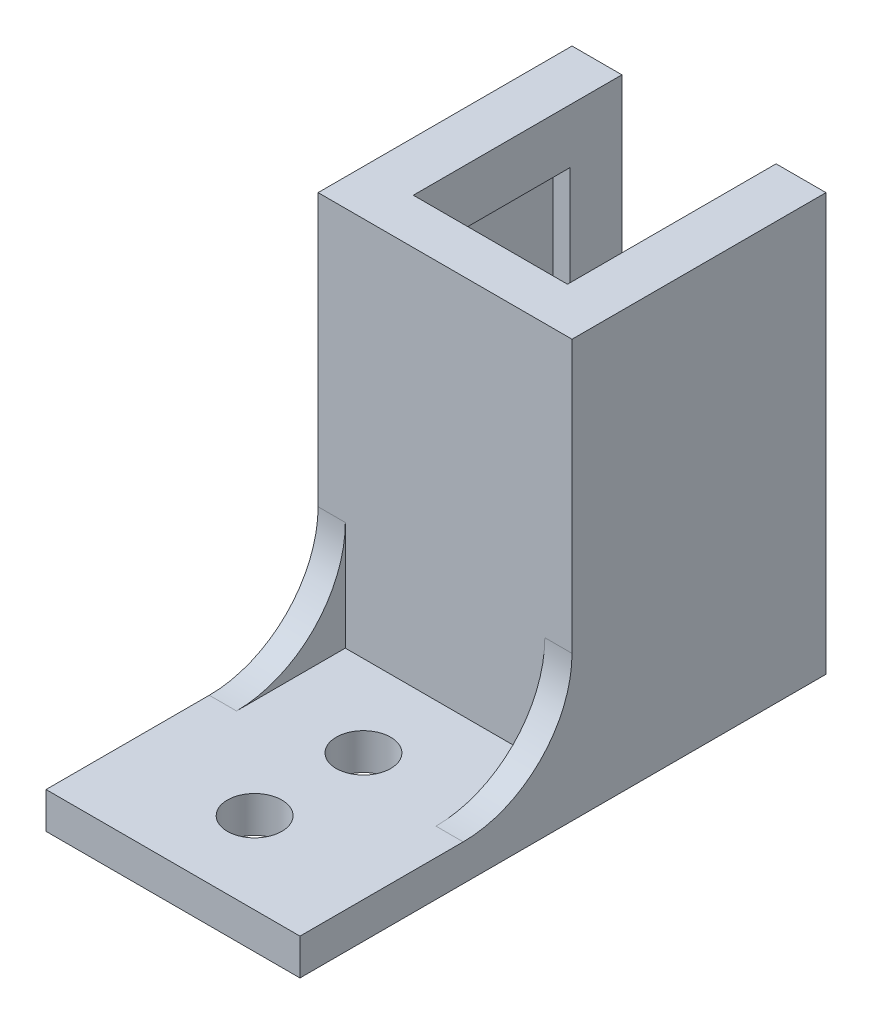
ISO-10303-21;
HEADER;
FILE_DESCRIPTION(('STEP AP214'),'2;1');
FILE_NAME('part.step','',(''),(''),'','','');
FILE_SCHEMA(('AUTOMOTIVE_DESIGN { 1 0 10303 214 1 1 1 1 }'));
ENDSEC;
DATA;
#1=APPLICATION_CONTEXT('core data for automotive mechanical design processes');
#2=APPLICATION_PROTOCOL_DEFINITION('international standard','automotive_design',2000,#1);
#3=PRODUCT_CONTEXT('',#1,'mechanical');
#4=PRODUCT('Part','Part','',(#3));
#5=PRODUCT_RELATED_PRODUCT_CATEGORY('part','',(#4));
#6=PRODUCT_DEFINITION_FORMATION('','',#4);
#7=PRODUCT_DEFINITION_CONTEXT('part definition',#1,'design');
#8=PRODUCT_DEFINITION('design','',#6,#7);
#9=PRODUCT_DEFINITION_SHAPE('','',#8);
#10=(LENGTH_UNIT() NAMED_UNIT(*) SI_UNIT(.MILLI.,.METRE.));
#11=(NAMED_UNIT(*) PLANE_ANGLE_UNIT() SI_UNIT($,.RADIAN.));
#12=(NAMED_UNIT(*) SI_UNIT($,.STERADIAN.) SOLID_ANGLE_UNIT());
#13=UNCERTAINTY_MEASURE_WITH_UNIT(LENGTH_MEASURE(1.E-05),#10,'distance_accuracy_value','');
#14=(GEOMETRIC_REPRESENTATION_CONTEXT(3) GLOBAL_UNCERTAINTY_ASSIGNED_CONTEXT((#13)) GLOBAL_UNIT_ASSIGNED_CONTEXT((#10,
#11,#12)) REPRESENTATION_CONTEXT('',''));
#15=CARTESIAN_POINT('',(0.,0.,0.));
#16=DIRECTION('',(0.,0.,1.));
#17=DIRECTION('',(1.,0.,0.));
#18=AXIS2_PLACEMENT_3D('',#15,#16,#17);
#19=CARTESIAN_POINT('',(0.,0.,0.));
#20=DIRECTION('',(0.,0.,1.));
#21=DIRECTION('',(1.,0.,0.));
#22=AXIS2_PLACEMENT_3D('',#19,#20,#21);
#23=PLANE('',#22);
#24=DIRECTION('',(0.,-1.,0.));
#25=VECTOR('',#24,1.);
#26=CARTESIAN_POINT('',(4.25,8.5,0.));
#27=LINE('',#26,#25);
#28=CARTESIAN_POINT('',(4.25,11.5,0.));
#29=VERTEX_POINT('',#28);
#30=CARTESIAN_POINT('',(4.25,-11.5,0.));
#31=VERTEX_POINT('',#30);
#32=EDGE_CURVE('E348',#29,#31,#27,.T.);
#33=ORIENTED_EDGE('',*,*,#32,.F.);
#34=DIRECTION('',(-1.,0.,0.));
#35=VECTOR('',#34,1.);
#36=CARTESIAN_POINT('',(0.,11.5,0.));
#37=LINE('',#36,#35);
#38=CARTESIAN_POINT('',(7.,11.5,0.));
#39=VERTEX_POINT('',#38);
#40=EDGE_CURVE('E200',#39,#29,#37,.T.);
#41=ORIENTED_EDGE('',*,*,#40,.F.);
#42=DIRECTION('',(0.,-1.,0.));
#43=VECTOR('',#42,1.);
#44=CARTESIAN_POINT('',(7.,0.,0.));
#45=LINE('',#44,#43);
#46=CARTESIAN_POINT('',(7.,-11.5,0.));
#47=VERTEX_POINT('',#46);
#48=EDGE_CURVE('E365',#39,#47,#45,.T.);
#49=ORIENTED_EDGE('',*,*,#48,.T.);
#50=DIRECTION('',(-1.,0.,0.));
#51=VECTOR('',#50,1.);
#52=CARTESIAN_POINT('',(0.,-11.5,0.));
#53=LINE('',#52,#51);
#54=EDGE_CURVE('E380',#47,#31,#53,.T.);
#55=ORIENTED_EDGE('',*,*,#54,.T.);
#56=EDGE_LOOP('',(#33,#41,#49,#55));
#57=FACE_BOUND('',#56,.T.);
#58=ADVANCED_FACE('F41',(#57),#23,.F.);
#59=CARTESIAN_POINT('',(0.,8.5,0.));
#60=DIRECTION('',(0.,-1.,0.));
#61=DIRECTION('',(1.,0.,0.));
#62=AXIS2_PLACEMENT_3D('',#59,#60,#61);
#63=PLANE('',#62);
#64=DIRECTION('',(0.,0.,1.));
#65=VECTOR('',#64,1.);
#66=CARTESIAN_POINT('',(4.25,8.5,0.));
#67=LINE('',#66,#65);
#68=CARTESIAN_POINT('',(4.25,8.5,2.85));
#69=VERTEX_POINT('',#68);
#70=CARTESIAN_POINT('',(4.25,8.5,11.5));
#71=VERTEX_POINT('',#70);
#72=EDGE_CURVE('E11',#69,#71,#67,.T.);
#73=ORIENTED_EDGE('',*,*,#72,.F.);
#74=DIRECTION('',(-1.,0.,0.));
#75=VECTOR('',#74,1.);
#76=CARTESIAN_POINT('',(0.,8.5,2.85));
#77=LINE('',#76,#75);
#78=CARTESIAN_POINT('',(5.2,8.5,2.85));
#79=VERTEX_POINT('',#78);
#80=EDGE_CURVE('E304',#79,#69,#77,.T.);
#81=ORIENTED_EDGE('',*,*,#80,.F.);
#82=DIRECTION('',(0.,0.,1.));
#83=VECTOR('',#82,1.);
#84=CARTESIAN_POINT('',(5.2,8.5,0.));
#85=LINE('',#84,#83);
#86=CARTESIAN_POINT('',(5.2,8.5,11.5));
#87=VERTEX_POINT('',#86);
#88=EDGE_CURVE('E305',#79,#87,#85,.T.);
#89=ORIENTED_EDGE('',*,*,#88,.T.);
#90=DIRECTION('',(-1.,0.,0.));
#91=VECTOR('',#90,1.);
#92=CARTESIAN_POINT('',(0.,8.5,11.5));
#93=LINE('',#92,#91);
#94=EDGE_CURVE('E310',#87,#71,#93,.T.);
#95=ORIENTED_EDGE('',*,*,#94,.T.);
#96=EDGE_LOOP('',(#73,#81,#89,#95));
#97=FACE_BOUND('',#96,.T.);
#98=ADVANCED_FACE('F469',(#97),#63,.T.);
#99=CARTESIAN_POINT('',(0.,0.,14.));
#100=DIRECTION('',(0.,0.,1.));
#101=DIRECTION('',(1.,0.,0.));
#102=AXIS2_PLACEMENT_3D('',#99,#100,#101);
#103=PLANE('',#102);
#104=DIRECTION('',(0.,-1.,0.));
#105=VECTOR('',#104,1.);
#106=CARTESIAN_POINT('',(5.5,-3.5,14.));
#107=LINE('',#106,#105);
#108=CARTESIAN_POINT('',(5.5,-3.5,14.));
#109=VERTEX_POINT('',#108);
#110=CARTESIAN_POINT('',(5.5,-9.5,14.));
#111=VERTEX_POINT('',#110);
#112=EDGE_CURVE('E217',#109,#111,#107,.T.);
#113=ORIENTED_EDGE('',*,*,#112,.F.);
#114=DIRECTION('',(1.,0.,0.));
#115=VECTOR('',#114,1.);
#116=CARTESIAN_POINT('',(5.5,-3.5,14.));
#117=LINE('',#116,#115);
#118=CARTESIAN_POINT('',(7.,-3.5,14.));
#119=VERTEX_POINT('',#118);
#120=EDGE_CURVE('E223',#109,#119,#117,.T.);
#121=ORIENTED_EDGE('',*,*,#120,.T.);
#122=DIRECTION('',(0.,-1.,0.));
#123=VECTOR('',#122,1.);
#124=CARTESIAN_POINT('',(7.,0.,14.));
#125=LINE('',#124,#123);
#126=CARTESIAN_POINT('',(7.,11.5,14.));
#127=VERTEX_POINT('',#126);
#128=EDGE_CURVE('E369',#127,#119,#125,.T.);
#129=ORIENTED_EDGE('',*,*,#128,.F.);
#130=DIRECTION('',(-1.,0.,0.));
#131=VECTOR('',#130,1.);
#132=CARTESIAN_POINT('',(0.,11.5,14.));
#133=LINE('',#132,#131);
#134=CARTESIAN_POINT('',(-7.,11.5,14.));
#135=VERTEX_POINT('',#134);
#136=EDGE_CURVE('E360',#127,#135,#133,.T.);
#137=ORIENTED_EDGE('',*,*,#136,.T.);
#138=DIRECTION('',(0.,-1.,0.));
#139=VECTOR('',#138,1.);
#140=CARTESIAN_POINT('',(-7.,0.,14.));
#141=LINE('',#140,#139);
#142=CARTESIAN_POINT('',(-7.,-3.5,14.));
#143=VERTEX_POINT('',#142);
#144=EDGE_CURVE('E364',#135,#143,#141,.T.);
#145=ORIENTED_EDGE('',*,*,#144,.T.);
#146=DIRECTION('',(-1.,0.,0.));
#147=VECTOR('',#146,1.);
#148=CARTESIAN_POINT('',(-5.5,-3.5,14.));
#149=LINE('',#148,#147);
#150=CARTESIAN_POINT('',(-5.5,-3.5,14.));
#151=VERTEX_POINT('',#150);
#152=EDGE_CURVE('E242',#151,#143,#149,.T.);
#153=ORIENTED_EDGE('',*,*,#152,.F.);
#154=DIRECTION('',(0.,-1.,0.));
#155=VECTOR('',#154,1.);
#156=CARTESIAN_POINT('',(-5.5,-3.5,14.));
#157=LINE('',#156,#155);
#158=CARTESIAN_POINT('',(-5.5,-9.5,14.));
#159=VERTEX_POINT('',#158);
#160=EDGE_CURVE('E234',#151,#159,#157,.T.);
#161=ORIENTED_EDGE('',*,*,#160,.T.);
#162=DIRECTION('',(1.,0.,0.));
#163=VECTOR('',#162,1.);
#164=CARTESIAN_POINT('',(7.,-9.5,14.));
#165=LINE('',#164,#163);
#166=EDGE_CURVE('E280',#159,#111,#165,.T.);
#167=ORIENTED_EDGE('',*,*,#166,.T.);
#168=EDGE_LOOP('',(#113,#121,#129,#137,#145,#153,#161,#167));
#169=FACE_BOUND('',#168,.T.);
#170=ADVANCED_FACE('F428',(#169),#103,.T.);
#171=CARTESIAN_POINT('',(0.,-9.5,0.));
#172=DIRECTION('',(0.,-1.,0.));
#173=DIRECTION('',(1.,0.,0.));
#174=AXIS2_PLACEMENT_3D('',#171,#172,#173);
#175=PLANE('',#174);
#176=CARTESIAN_POINT('',(0.,-9.5,24.5));
#177=DIRECTION('',(0.,-1.,0.));
#178=DIRECTION('',(1.,0.,0.));
#179=AXIS2_PLACEMENT_3D('',#176,#177,#178);
#180=CIRCLE('',#179,1.5);
#181=CARTESIAN_POINT('',(1.50000000000001,-9.5,24.5));
#182=VERTEX_POINT('',#181);
#183=EDGE_CURVE('E253',#182,#182,#180,.T.);
#184=ORIENTED_EDGE('',*,*,#183,.T.);
#185=EDGE_LOOP('',(#184));
#186=FACE_BOUND('',#185,.T.);
#187=CARTESIAN_POINT('',(0.,-9.5,18.5));
#188=DIRECTION('',(0.,-1.,0.));
#189=DIRECTION('',(1.,0.,0.));
#190=AXIS2_PLACEMENT_3D('',#187,#188,#189);
#191=CIRCLE('',#190,1.5);
#192=CARTESIAN_POINT('',(1.5,-9.5,18.5));
#193=VERTEX_POINT('',#192);
#194=EDGE_CURVE('E261',#193,#193,#191,.T.);
#195=ORIENTED_EDGE('',*,*,#194,.T.);
#196=EDGE_LOOP('',(#195));
#197=FACE_BOUND('',#196,.T.);
#198=DIRECTION('',(1.,0.,0.));
#199=VECTOR('',#198,1.);
#200=CARTESIAN_POINT('',(5.5,-9.5,20.));
#201=LINE('',#200,#199);
#202=CARTESIAN_POINT('',(5.5,-9.5,20.));
#203=VERTEX_POINT('',#202);
#204=CARTESIAN_POINT('',(7.,-9.5,20.));
#205=VERTEX_POINT('',#204);
#206=EDGE_CURVE('E220',#203,#205,#201,.T.);
#207=ORIENTED_EDGE('',*,*,#206,.F.);
#208=DIRECTION('',(0.,0.,1.));
#209=VECTOR('',#208,1.);
#210=CARTESIAN_POINT('',(5.5,-9.5,14.));
#211=LINE('',#210,#209);
#212=EDGE_CURVE('E214',#111,#203,#211,.T.);
#213=ORIENTED_EDGE('',*,*,#212,.F.);
#214=ORIENTED_EDGE('',*,*,#166,.F.);
#215=DIRECTION('',(0.,0.,1.));
#216=VECTOR('',#215,1.);
#217=CARTESIAN_POINT('',(-5.5,-9.5,14.));
#218=LINE('',#217,#216);
#219=CARTESIAN_POINT('',(-5.5,-9.5,20.));
#220=VERTEX_POINT('',#219);
#221=EDGE_CURVE('E238',#159,#220,#218,.T.);
#222=ORIENTED_EDGE('',*,*,#221,.T.);
#223=DIRECTION('',(-1.,0.,0.));
#224=VECTOR('',#223,1.);
#225=CARTESIAN_POINT('',(-5.5,-9.5,20.));
#226=LINE('',#225,#224);
#227=CARTESIAN_POINT('',(-7.,-9.5,20.));
#228=VERTEX_POINT('',#227);
#229=EDGE_CURVE('E246',#220,#228,#226,.T.);
#230=ORIENTED_EDGE('',*,*,#229,.T.);
#231=DIRECTION('',(0.,0.,-1.));
#232=VECTOR('',#231,1.);
#233=CARTESIAN_POINT('',(-7.,-9.5,14.));
#234=LINE('',#233,#232);
#235=CARTESIAN_POINT('',(-7.,-9.5,29.));
#236=VERTEX_POINT('',#235);
#237=EDGE_CURVE('E276',#236,#228,#234,.T.);
#238=ORIENTED_EDGE('',*,*,#237,.F.);
#239=DIRECTION('',(-1.,0.,0.));
#240=VECTOR('',#239,1.);
#241=CARTESIAN_POINT('',(7.,-9.5,29.));
#242=LINE('',#241,#240);
#243=CARTESIAN_POINT('',(7.,-9.5,29.));
#244=VERTEX_POINT('',#243);
#245=EDGE_CURVE('E272',#244,#236,#242,.T.);
#246=ORIENTED_EDGE('',*,*,#245,.F.);
#247=DIRECTION('',(0.,0.,1.));
#248=VECTOR('',#247,1.);
#249=CARTESIAN_POINT('',(7.,-9.5,14.));
#250=LINE('',#249,#248);
#251=EDGE_CURVE('E269',#205,#244,#250,.T.);
#252=ORIENTED_EDGE('',*,*,#251,.F.);
#253=EDGE_LOOP('',(#207,#213,#214,#222,#230,#238,#246,#252));
#254=FACE_BOUND('',#253,.T.);
#255=ADVANCED_FACE('F423',(#186,#197,#254),#175,.F.);
#256=CARTESIAN_POINT('',(0.,-11.5,14.));
#257=DIRECTION('',(0.,-1.,0.));
#258=DIRECTION('',(1.,0.,0.));
#259=AXIS2_PLACEMENT_3D('',#256,#257,#258);
#260=PLANE('',#259);
#261=DIRECTION('',(-1.,0.,0.));
#262=VECTOR('',#261,1.);
#263=CARTESIAN_POINT('',(0.,-11.5,2.85));
#264=LINE('',#263,#262);
#265=CARTESIAN_POINT('',(5.2,-11.5,2.85));
#266=VERTEX_POINT('',#265);
#267=CARTESIAN_POINT('',(4.25,-11.5,2.85));
#268=VERTEX_POINT('',#267);
#269=EDGE_CURVE('E322',#266,#268,#264,.T.);
#270=ORIENTED_EDGE('',*,*,#269,.T.);
#271=DIRECTION('',(0.,0.,-1.));
#272=VECTOR('',#271,1.);
#273=CARTESIAN_POINT('',(4.25,-11.5,0.));
#274=LINE('',#273,#272);
#275=EDGE_CURVE('E325',#268,#31,#274,.T.);
#276=ORIENTED_EDGE('',*,*,#275,.T.);
#277=ORIENTED_EDGE('',*,*,#54,.F.);
#278=DIRECTION('',(0.,0.,-1.));
#279=VECTOR('',#278,1.);
#280=CARTESIAN_POINT('',(7.,-11.5,14.));
#281=LINE('',#280,#279);
#282=CARTESIAN_POINT('',(7.,-11.5,29.));
#283=VERTEX_POINT('',#282);
#284=EDGE_CURVE('E389',#283,#47,#281,.T.);
#285=ORIENTED_EDGE('',*,*,#284,.F.);
#286=DIRECTION('',(-1.,0.,0.));
#287=VECTOR('',#286,1.);
#288=CARTESIAN_POINT('',(7.,-11.5,29.));
#289=LINE('',#288,#287);
#290=CARTESIAN_POINT('',(-7.,-11.5,29.));
#291=VERTEX_POINT('',#290);
#292=EDGE_CURVE('E265',#283,#291,#289,.T.);
#293=ORIENTED_EDGE('',*,*,#292,.T.);
#294=DIRECTION('',(0.,0.,-1.));
#295=VECTOR('',#294,1.);
#296=CARTESIAN_POINT('',(-7.,-11.5,14.));
#297=LINE('',#296,#295);
#298=CARTESIAN_POINT('',(-7.,-11.5,0.));
#299=VERTEX_POINT('',#298);
#300=EDGE_CURVE('E392',#291,#299,#297,.T.);
#301=ORIENTED_EDGE('',*,*,#300,.T.);
#302=CARTESIAN_POINT('',(-4.25,-11.5,0.));
#303=VERTEX_POINT('',#302);
#304=EDGE_CURVE('E379',#303,#299,#53,.T.);
#305=ORIENTED_EDGE('',*,*,#304,.F.);
#306=DIRECTION('',(0.,0.,-1.));
#307=VECTOR('',#306,1.);
#308=CARTESIAN_POINT('',(-4.25,-11.5,0.));
#309=LINE('',#308,#307);
#310=CARTESIAN_POINT('',(-4.25,-11.5,2.85));
#311=VERTEX_POINT('',#310);
#312=EDGE_CURVE('E321',#311,#303,#309,.T.);
#313=ORIENTED_EDGE('',*,*,#312,.F.);
#314=CARTESIAN_POINT('',(-5.2,-11.5,2.85));
#315=VERTEX_POINT('',#314);
#316=EDGE_CURVE('E317',#311,#315,#264,.T.);
#317=ORIENTED_EDGE('',*,*,#316,.T.);
#318=DIRECTION('',(0.,0.,1.));
#319=VECTOR('',#318,1.);
#320=CARTESIAN_POINT('',(-5.2,-11.5,0.));
#321=LINE('',#320,#319);
#322=CARTESIAN_POINT('',(-5.2,-11.5,11.5));
#323=VERTEX_POINT('',#322);
#324=EDGE_CURVE('E292',#315,#323,#321,.T.);
#325=ORIENTED_EDGE('',*,*,#324,.T.);
#326=DIRECTION('',(-1.,0.,0.));
#327=VECTOR('',#326,1.);
#328=CARTESIAN_POINT('',(0.,-11.5,11.5));
#329=LINE('',#328,#327);
#330=CARTESIAN_POINT('',(5.2,-11.5,11.5));
#331=VERTEX_POINT('',#330);
#332=EDGE_CURVE('E301',#331,#323,#329,.T.);
#333=ORIENTED_EDGE('',*,*,#332,.F.);
#334=DIRECTION('',(0.,0.,1.));
#335=VECTOR('',#334,1.);
#336=CARTESIAN_POINT('',(5.2,-11.5,0.));
#337=LINE('',#336,#335);
#338=EDGE_CURVE('E329',#266,#331,#337,.T.);
#339=ORIENTED_EDGE('',*,*,#338,.F.);
#340=EDGE_LOOP('',(#270,#276,#277,#285,#293,#301,#305,#313,#317,#325,#333,#339));
#341=FACE_BOUND('',#340,.T.);
#342=CARTESIAN_POINT('',(0.,-11.5,24.5));
#343=DIRECTION('',(0.,-1.,0.));
#344=DIRECTION('',(1.,0.,0.));
#345=AXIS2_PLACEMENT_3D('',#342,#343,#344);
#346=CIRCLE('',#345,1.5);
#347=CARTESIAN_POINT('',(1.50000000000001,-11.5,24.5));
#348=VERTEX_POINT('',#347);
#349=EDGE_CURVE('E250',#348,#348,#346,.T.);
#350=ORIENTED_EDGE('',*,*,#349,.F.);
#351=EDGE_LOOP('',(#350));
#352=FACE_BOUND('',#351,.T.);
#353=CARTESIAN_POINT('',(0.,-11.5,18.5));
#354=DIRECTION('',(0.,-1.,0.));
#355=DIRECTION('',(1.,0.,0.));
#356=AXIS2_PLACEMENT_3D('',#353,#354,#355);
#357=CIRCLE('',#356,1.5);
#358=CARTESIAN_POINT('',(1.50000000000001,-11.5,18.5));
#359=VERTEX_POINT('',#358);
#360=EDGE_CURVE('E257',#359,#359,#357,.T.);
#361=ORIENTED_EDGE('',*,*,#360,.F.);
#362=EDGE_LOOP('',(#361));
#363=FACE_BOUND('',#362,.T.);
#364=ADVANCED_FACE('F412',(#341,#352,#363),#260,.T.);
#365=CARTESIAN_POINT('',(-4.25,11.5,0.));
#366=VERTEX_POINT('',#365);
#367=CARTESIAN_POINT('',(-7.,11.5,0.));
#368=VERTEX_POINT('',#367);
#369=EDGE_CURVE('E338',#366,#368,#37,.T.);
#370=ORIENTED_EDGE('',*,*,#369,.F.);
#371=DIRECTION('',(0.,-1.,0.));
#372=VECTOR('',#371,1.);
#373=CARTESIAN_POINT('',(-4.25,8.5,0.));
#374=LINE('',#373,#372);
#375=EDGE_CURVE('E351',#366,#303,#374,.T.);
#376=ORIENTED_EDGE('',*,*,#375,.T.);
#377=ORIENTED_EDGE('',*,*,#304,.T.);
#378=DIRECTION('',(0.,-1.,0.));
#379=VECTOR('',#378,1.);
#380=CARTESIAN_POINT('',(-7.,0.,0.));
#381=LINE('',#380,#379);
#382=EDGE_CURVE('E375',#368,#299,#381,.T.);
#383=ORIENTED_EDGE('',*,*,#382,.F.);
#384=EDGE_LOOP('',(#370,#376,#377,#383));
#385=FACE_BOUND('',#384,.T.);
#386=ADVANCED_FACE('F406',(#385),#23,.F.);
#387=CARTESIAN_POINT('',(0.,11.5,14.));
#388=DIRECTION('',(0.,-1.,0.));
#389=DIRECTION('',(1.,0.,0.));
#390=AXIS2_PLACEMENT_3D('',#387,#388,#389);
#391=PLANE('',#390);
#392=ORIENTED_EDGE('',*,*,#40,.T.);
#393=DIRECTION('',(0.,0.,1.));
#394=VECTOR('',#393,1.);
#395=CARTESIAN_POINT('',(4.25,11.5,0.));
#396=LINE('',#395,#394);
#397=CARTESIAN_POINT('',(4.25,11.5,11.5));
#398=VERTEX_POINT('',#397);
#399=EDGE_CURVE('E181',#29,#398,#396,.T.);
#400=ORIENTED_EDGE('',*,*,#399,.T.);
#401=DIRECTION('',(-1.,0.,0.));
#402=VECTOR('',#401,1.);
#403=CARTESIAN_POINT('',(4.25,11.5,11.5));
#404=LINE('',#403,#402);
#405=CARTESIAN_POINT('',(-4.25,11.5,11.5));
#406=VERTEX_POINT('',#405);
#407=EDGE_CURVE('E190',#398,#406,#404,.T.);
#408=ORIENTED_EDGE('',*,*,#407,.T.);
#409=DIRECTION('',(0.,0.,-1.));
#410=VECTOR('',#409,1.);
#411=CARTESIAN_POINT('',(-4.25,11.5,0.));
#412=LINE('',#411,#410);
#413=EDGE_CURVE('E187',#406,#366,#412,.T.);
#414=ORIENTED_EDGE('',*,*,#413,.T.);
#415=ORIENTED_EDGE('',*,*,#369,.T.);
#416=DIRECTION('',(0.,0.,-1.));
#417=VECTOR('',#416,1.);
#418=CARTESIAN_POINT('',(-7.,11.5,14.));
#419=LINE('',#418,#417);
#420=EDGE_CURVE('E50',#135,#368,#419,.T.);
#421=ORIENTED_EDGE('',*,*,#420,.F.);
#422=ORIENTED_EDGE('',*,*,#136,.F.);
#423=DIRECTION('',(0.,0.,-1.));
#424=VECTOR('',#423,1.);
#425=CARTESIAN_POINT('',(7.,11.5,14.));
#426=LINE('',#425,#424);
#427=EDGE_CURVE('E372',#127,#39,#426,.T.);
#428=ORIENTED_EDGE('',*,*,#427,.T.);
#429=EDGE_LOOP('',(#392,#400,#408,#414,#415,#421,#422,#428));
#430=FACE_BOUND('',#429,.T.);
#431=ADVANCED_FACE('F43',(#430),#391,.F.);
#432=CARTESIAN_POINT('',(-7.,0.,14.));
#433=DIRECTION('',(1.,0.,0.));
#434=DIRECTION('',(0.,1.,0.));
#435=AXIS2_PLACEMENT_3D('',#432,#433,#434);
#436=PLANE('',#435);
#437=ORIENTED_EDGE('',*,*,#382,.T.);
#438=ORIENTED_EDGE('',*,*,#300,.F.);
#439=DIRECTION('',(0.,-1.,0.));
#440=VECTOR('',#439,1.);
#441=CARTESIAN_POINT('',(-7.,-9.5,29.));
#442=LINE('',#441,#440);
#443=EDGE_CURVE('E288',#236,#291,#442,.T.);
#444=ORIENTED_EDGE('',*,*,#443,.F.);
#445=ORIENTED_EDGE('',*,*,#237,.T.);
#446=CARTESIAN_POINT('',(-7.,-3.5,20.));
#447=DIRECTION('',(1.,0.,0.));
#448=DIRECTION('',(0.,1.,0.));
#449=AXIS2_PLACEMENT_3D('',#446,#447,#448);
#450=CIRCLE('',#449,6.);
#451=EDGE_CURVE('E227',#228,#143,#450,.T.);
#452=ORIENTED_EDGE('',*,*,#451,.T.);
#453=ORIENTED_EDGE('',*,*,#144,.F.);
#454=ORIENTED_EDGE('',*,*,#420,.T.);
#455=EDGE_LOOP('',(#437,#438,#444,#445,#452,#453,#454));
#456=FACE_BOUND('',#455,.T.);
#457=ADVANCED_FACE('F399',(#456),#436,.F.);
#458=CARTESIAN_POINT('',(7.,0.,14.));
#459=DIRECTION('',(1.,0.,0.));
#460=DIRECTION('',(0.,1.,0.));
#461=AXIS2_PLACEMENT_3D('',#458,#459,#460);
#462=PLANE('',#461);
#463=ORIENTED_EDGE('',*,*,#48,.F.);
#464=ORIENTED_EDGE('',*,*,#427,.F.);
#465=ORIENTED_EDGE('',*,*,#128,.T.);
#466=CARTESIAN_POINT('',(7.,-3.5,20.));
#467=DIRECTION('',(1.,0.,0.));
#468=DIRECTION('',(0.,1.,0.));
#469=AXIS2_PLACEMENT_3D('',#466,#467,#468);
#470=CIRCLE('',#469,6.);
#471=EDGE_CURVE('E64',#205,#119,#470,.T.);
#472=ORIENTED_EDGE('',*,*,#471,.F.);
#473=ORIENTED_EDGE('',*,*,#251,.T.);
#474=DIRECTION('',(0.,-1.,0.));
#475=VECTOR('',#474,1.);
#476=CARTESIAN_POINT('',(7.,-9.5,29.));
#477=LINE('',#476,#475);
#478=EDGE_CURVE('E284',#244,#283,#477,.T.);
#479=ORIENTED_EDGE('',*,*,#478,.T.);
#480=ORIENTED_EDGE('',*,*,#284,.T.);
#481=EDGE_LOOP('',(#463,#464,#465,#472,#473,#479,#480));
#482=FACE_BOUND('',#481,.T.);
#483=ADVANCED_FACE('F431',(#482),#462,.T.);
#484=CARTESIAN_POINT('',(-5.2,8.5,0.));
#485=DIRECTION('',(1.,0.,0.));
#486=DIRECTION('',(0.,1.,0.));
#487=AXIS2_PLACEMENT_3D('',#484,#485,#486);
#488=PLANE('',#487);
#489=ORIENTED_EDGE('',*,*,#324,.F.);
#490=DIRECTION('',(0.,-1.,0.));
#491=VECTOR('',#490,1.);
#492=CARTESIAN_POINT('',(-5.2,8.5,2.85));
#493=LINE('',#492,#491);
#494=CARTESIAN_POINT('',(-5.2,8.5,2.85));
#495=VERTEX_POINT('',#494);
#496=EDGE_CURVE('E313',#495,#315,#493,.T.);
#497=ORIENTED_EDGE('',*,*,#496,.F.);
#498=DIRECTION('',(0.,0.,1.));
#499=VECTOR('',#498,1.);
#500=CARTESIAN_POINT('',(-5.2,8.5,0.));
#501=LINE('',#500,#499);
#502=CARTESIAN_POINT('',(-5.2,8.5,11.5));
#503=VERTEX_POINT('',#502);
#504=EDGE_CURVE('E296',#495,#503,#501,.T.);
#505=ORIENTED_EDGE('',*,*,#504,.T.);
#506=DIRECTION('',(0.,-1.,0.));
#507=VECTOR('',#506,1.);
#508=CARTESIAN_POINT('',(-5.2,8.5,11.5));
#509=LINE('',#508,#507);
#510=EDGE_CURVE('E335',#503,#323,#509,.T.);
#511=ORIENTED_EDGE('',*,*,#510,.T.);
#512=EDGE_LOOP('',(#489,#497,#505,#511));
#513=FACE_BOUND('',#512,.T.);
#514=ADVANCED_FACE('F451',(#513),#488,.T.);
#515=CARTESIAN_POINT('',(0.,8.5,11.5));
#516=DIRECTION('',(0.,0.,1.));
#517=DIRECTION('',(1.,0.,0.));
#518=AXIS2_PLACEMENT_3D('',#515,#516,#517);
#519=PLANE('',#518);
#520=ORIENTED_EDGE('',*,*,#332,.T.);
#521=ORIENTED_EDGE('',*,*,#510,.F.);
#522=CARTESIAN_POINT('',(-4.25,8.5,11.5));
#523=VERTEX_POINT('',#522);
#524=EDGE_CURVE('E309',#523,#503,#93,.T.);
#525=ORIENTED_EDGE('',*,*,#524,.F.);
#526=DIRECTION('',(0.,-1.,0.));
#527=VECTOR('',#526,1.);
#528=CARTESIAN_POINT('',(-4.25,11.5,11.5));
#529=LINE('',#528,#527);
#530=EDGE_CURVE('E186',#406,#523,#529,.T.);
#531=ORIENTED_EDGE('',*,*,#530,.F.);
#532=ORIENTED_EDGE('',*,*,#407,.F.);
#533=DIRECTION('',(0.,-1.,0.));
#534=VECTOR('',#533,1.);
#535=CARTESIAN_POINT('',(4.25,11.5,11.5));
#536=LINE('',#535,#534);
#537=EDGE_CURVE('E57',#398,#71,#536,.T.);
#538=ORIENTED_EDGE('',*,*,#537,.T.);
#539=ORIENTED_EDGE('',*,*,#94,.F.);
#540=DIRECTION('',(0.,-1.,0.));
#541=VECTOR('',#540,1.);
#542=CARTESIAN_POINT('',(5.2,8.5,11.5));
#543=LINE('',#542,#541);
#544=EDGE_CURVE('E339',#87,#331,#543,.T.);
#545=ORIENTED_EDGE('',*,*,#544,.T.);
#546=EDGE_LOOP('',(#520,#521,#525,#531,#532,#538,#539,#545));
#547=FACE_BOUND('',#546,.T.);
#548=ADVANCED_FACE('F192',(#547),#519,.F.);
#549=CARTESIAN_POINT('',(5.2,8.5,0.));
#550=DIRECTION('',(1.,0.,0.));
#551=DIRECTION('',(0.,1.,0.));
#552=AXIS2_PLACEMENT_3D('',#549,#550,#551);
#553=PLANE('',#552);
#554=ORIENTED_EDGE('',*,*,#338,.T.);
#555=ORIENTED_EDGE('',*,*,#544,.F.);
#556=ORIENTED_EDGE('',*,*,#88,.F.);
#557=DIRECTION('',(0.,-1.,0.));
#558=VECTOR('',#557,1.);
#559=CARTESIAN_POINT('',(5.2,8.5,2.85));
#560=LINE('',#559,#558);
#561=EDGE_CURVE('E342',#79,#266,#560,.T.);
#562=ORIENTED_EDGE('',*,*,#561,.T.);
#563=EDGE_LOOP('',(#554,#555,#556,#562));
#564=FACE_BOUND('',#563,.T.);
#565=ADVANCED_FACE('F499',(#564),#553,.F.);
#566=CARTESIAN_POINT('',(0.,8.5,2.85));
#567=DIRECTION('',(0.,0.,1.));
#568=DIRECTION('',(1.,0.,0.));
#569=AXIS2_PLACEMENT_3D('',#566,#567,#568);
#570=PLANE('',#569);
#571=ORIENTED_EDGE('',*,*,#269,.F.);
#572=ORIENTED_EDGE('',*,*,#561,.F.);
#573=ORIENTED_EDGE('',*,*,#80,.T.);
#574=DIRECTION('',(0.,-1.,0.));
#575=VECTOR('',#574,1.);
#576=CARTESIAN_POINT('',(4.25,8.5,2.85));
#577=LINE('',#576,#575);
#578=EDGE_CURVE('E345',#69,#268,#577,.T.);
#579=ORIENTED_EDGE('',*,*,#578,.T.);
#580=EDGE_LOOP('',(#571,#572,#573,#579));
#581=FACE_BOUND('',#580,.T.);
#582=ADVANCED_FACE('F465',(#581),#570,.T.);
#583=CARTESIAN_POINT('',(4.25,8.5,0.));
#584=DIRECTION('',(-1.,0.,0.));
#585=DIRECTION('',(0.,0.,1.));
#586=AXIS2_PLACEMENT_3D('',#583,#584,#585);
#587=PLANE('',#586);
#588=ORIENTED_EDGE('',*,*,#275,.F.);
#589=ORIENTED_EDGE('',*,*,#578,.F.);
#590=ORIENTED_EDGE('',*,*,#72,.T.);
#591=ORIENTED_EDGE('',*,*,#537,.F.);
#592=ORIENTED_EDGE('',*,*,#399,.F.);
#593=ORIENTED_EDGE('',*,*,#32,.T.);
#594=EDGE_LOOP('',(#588,#589,#590,#591,#592,#593));
#595=FACE_BOUND('',#594,.T.);
#596=ADVANCED_FACE('F179',(#595),#587,.T.);
#597=CARTESIAN_POINT('',(-4.25,8.5,0.));
#598=DIRECTION('',(-1.,0.,0.));
#599=DIRECTION('',(0.,0.,1.));
#600=AXIS2_PLACEMENT_3D('',#597,#598,#599);
#601=PLANE('',#600);
#602=ORIENTED_EDGE('',*,*,#312,.T.);
#603=ORIENTED_EDGE('',*,*,#375,.F.);
#604=ORIENTED_EDGE('',*,*,#413,.F.);
#605=ORIENTED_EDGE('',*,*,#530,.T.);
#606=DIRECTION('',(0.,0.,-1.));
#607=VECTOR('',#606,1.);
#608=CARTESIAN_POINT('',(-4.25,8.5,0.));
#609=LINE('',#608,#607);
#610=CARTESIAN_POINT('',(-4.25,8.5,2.85));
#611=VERTEX_POINT('',#610);
#612=EDGE_CURVE('E202',#523,#611,#609,.T.);
#613=ORIENTED_EDGE('',*,*,#612,.T.);
#614=DIRECTION('',(0.,-1.,0.));
#615=VECTOR('',#614,1.);
#616=CARTESIAN_POINT('',(-4.25,8.5,2.85));
#617=LINE('',#616,#615);
#618=EDGE_CURVE('E355',#611,#311,#617,.T.);
#619=ORIENTED_EDGE('',*,*,#618,.T.);
#620=EDGE_LOOP('',(#602,#603,#604,#605,#613,#619));
#621=FACE_BOUND('',#620,.T.);
#622=ADVANCED_FACE('F457',(#621),#601,.F.);
#623=ORIENTED_EDGE('',*,*,#316,.F.);
#624=ORIENTED_EDGE('',*,*,#618,.F.);
#625=EDGE_CURVE('E300',#611,#495,#77,.T.);
#626=ORIENTED_EDGE('',*,*,#625,.T.);
#627=ORIENTED_EDGE('',*,*,#496,.T.);
#628=EDGE_LOOP('',(#623,#624,#626,#627));
#629=FACE_BOUND('',#628,.T.);
#630=ADVANCED_FACE('F455',(#629),#570,.T.);
#631=ORIENTED_EDGE('',*,*,#612,.F.);
#632=ORIENTED_EDGE('',*,*,#524,.T.);
#633=ORIENTED_EDGE('',*,*,#504,.F.);
#634=ORIENTED_EDGE('',*,*,#625,.F.);
#635=EDGE_LOOP('',(#631,#632,#633,#634));
#636=FACE_BOUND('',#635,.T.);
#637=ADVANCED_FACE('F445',(#636),#63,.T.);
#638=CARTESIAN_POINT('',(7.,-9.5,29.));
#639=DIRECTION('',(0.,0.,1.));
#640=DIRECTION('',(1.,0.,0.));
#641=AXIS2_PLACEMENT_3D('',#638,#639,#640);
#642=PLANE('',#641);
#643=ORIENTED_EDGE('',*,*,#292,.F.);
#644=ORIENTED_EDGE('',*,*,#478,.F.);
#645=ORIENTED_EDGE('',*,*,#245,.T.);
#646=ORIENTED_EDGE('',*,*,#443,.T.);
#647=EDGE_LOOP('',(#643,#644,#645,#646));
#648=FACE_BOUND('',#647,.T.);
#649=ADVANCED_FACE('F417',(#648),#642,.T.);
#650=CARTESIAN_POINT('',(0.,-9.5,18.5));
#651=DIRECTION('',(0.,-1.,0.));
#652=DIRECTION('',(1.,0.,0.));
#653=AXIS2_PLACEMENT_3D('',#650,#651,#652);
#654=CYLINDRICAL_SURFACE('',#653,1.5);
#655=ORIENTED_EDGE('',*,*,#194,.F.);
#656=EDGE_LOOP('',(#655));
#657=FACE_BOUND('',#656,.T.);
#658=ORIENTED_EDGE('',*,*,#360,.T.);
#659=EDGE_LOOP('',(#658));
#660=FACE_BOUND('',#659,.T.);
#661=ADVANCED_FACE('F613',(#657,#660),#654,.F.);
#662=CARTESIAN_POINT('',(0.,-9.5,24.5));
#663=DIRECTION('',(0.,-1.,0.));
#664=DIRECTION('',(1.,0.,0.));
#665=AXIS2_PLACEMENT_3D('',#662,#663,#664);
#666=CYLINDRICAL_SURFACE('',#665,1.5);
#667=ORIENTED_EDGE('',*,*,#183,.F.);
#668=EDGE_LOOP('',(#667));
#669=FACE_BOUND('',#668,.T.);
#670=ORIENTED_EDGE('',*,*,#349,.T.);
#671=EDGE_LOOP('',(#670));
#672=FACE_BOUND('',#671,.T.);
#673=ADVANCED_FACE('F620',(#669,#672),#666,.F.);
#674=CARTESIAN_POINT('',(-5.5,-3.5,20.));
#675=DIRECTION('',(-1.,0.,0.));
#676=DIRECTION('',(0.,-1.,0.));
#677=AXIS2_PLACEMENT_3D('',#674,#675,#676);
#678=CYLINDRICAL_SURFACE('',#677,6.);
#679=ORIENTED_EDGE('',*,*,#451,.F.);
#680=ORIENTED_EDGE('',*,*,#229,.F.);
#681=CARTESIAN_POINT('',(-5.5,-3.5,20.));
#682=DIRECTION('',(1.,0.,0.));
#683=DIRECTION('',(0.,1.,0.));
#684=AXIS2_PLACEMENT_3D('',#681,#682,#683);
#685=CIRCLE('',#684,6.);
#686=EDGE_CURVE('E230',#220,#151,#685,.T.);
#687=ORIENTED_EDGE('',*,*,#686,.T.);
#688=ORIENTED_EDGE('',*,*,#152,.T.);
#689=EDGE_LOOP('',(#679,#680,#687,#688));
#690=FACE_BOUND('',#689,.T.);
#691=ADVANCED_FACE('F628',(#690),#678,.F.);
#692=CARTESIAN_POINT('',(-5.5,-3.5,20.));
#693=DIRECTION('',(1.,0.,0.));
#694=DIRECTION('',(0.,1.,0.));
#695=AXIS2_PLACEMENT_3D('',#692,#693,#694);
#696=PLANE('',#695);
#697=ORIENTED_EDGE('',*,*,#686,.F.);
#698=ORIENTED_EDGE('',*,*,#221,.F.);
#699=ORIENTED_EDGE('',*,*,#160,.F.);
#700=EDGE_LOOP('',(#697,#698,#699));
#701=FACE_BOUND('',#700,.T.);
#702=ADVANCED_FACE('F528',(#701),#696,.T.);
#703=CARTESIAN_POINT('',(5.5,-3.5,20.));
#704=DIRECTION('',(1.,0.,0.));
#705=DIRECTION('',(0.,1.,0.));
#706=AXIS2_PLACEMENT_3D('',#703,#704,#705);
#707=CYLINDRICAL_SURFACE('',#706,6.);
#708=ORIENTED_EDGE('',*,*,#471,.T.);
#709=ORIENTED_EDGE('',*,*,#120,.F.);
#710=CARTESIAN_POINT('',(5.5,-3.5,20.));
#711=DIRECTION('',(1.,0.,0.));
#712=DIRECTION('',(0.,1.,0.));
#713=AXIS2_PLACEMENT_3D('',#710,#711,#712);
#714=CIRCLE('',#713,6.);
#715=EDGE_CURVE('E211',#203,#109,#714,.T.);
#716=ORIENTED_EDGE('',*,*,#715,.F.);
#717=ORIENTED_EDGE('',*,*,#206,.T.);
#718=EDGE_LOOP('',(#708,#709,#716,#717));
#719=FACE_BOUND('',#718,.T.);
#720=ADVANCED_FACE('F523',(#719),#707,.F.);
#721=CARTESIAN_POINT('',(5.5,-3.5,20.));
#722=DIRECTION('',(-1.,0.,0.));
#723=DIRECTION('',(0.,1.,0.));
#724=AXIS2_PLACEMENT_3D('',#721,#722,#723);
#725=PLANE('',#724);
#726=ORIENTED_EDGE('',*,*,#715,.T.);
#727=ORIENTED_EDGE('',*,*,#112,.T.);
#728=ORIENTED_EDGE('',*,*,#212,.T.);
#729=EDGE_LOOP('',(#726,#727,#728));
#730=FACE_BOUND('',#729,.T.);
#731=ADVANCED_FACE('F527',(#730),#725,.T.);
#732=CLOSED_SHELL('',(#58,#98,#170,#255,#364,#386,#431,#457,#483,#514,#548,#565,#582,#596,#622,
#630,#637,#649,#661,#673,#691,#702,#720,#731));
#733=MANIFOLD_SOLID_BREP('B2',#732);
#734=ADVANCED_BREP_SHAPE_REPRESENTATION('',(#18,#733),#14);
#735=SHAPE_DEFINITION_REPRESENTATION(#9,#734);
ENDSEC;
END-ISO-10303-21;
